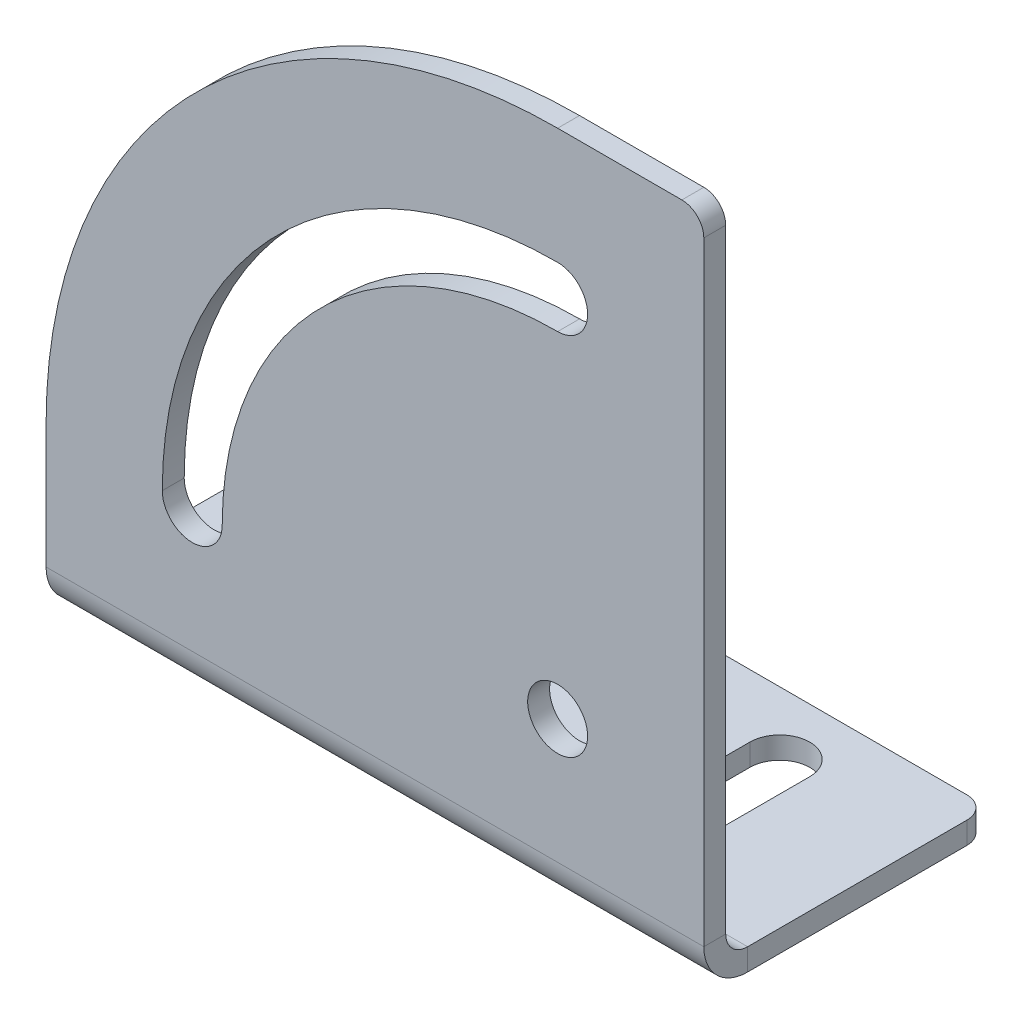
ISO-10303-21;
HEADER;
FILE_DESCRIPTION(('STEP AP214'),'2;1');
FILE_NAME('part.step','',(''),(''),'','','');
FILE_SCHEMA(('AUTOMOTIVE_DESIGN { 1 0 10303 214 1 1 1 1 }'));
ENDSEC;
DATA;
#1=APPLICATION_CONTEXT('core data for automotive mechanical design processes');
#2=APPLICATION_PROTOCOL_DEFINITION('international standard','automotive_design',2000,#1);
#3=PRODUCT_CONTEXT('',#1,'mechanical');
#4=PRODUCT('Part','Part','',(#3));
#5=PRODUCT_RELATED_PRODUCT_CATEGORY('part','',(#4));
#6=PRODUCT_DEFINITION_FORMATION('','',#4);
#7=PRODUCT_DEFINITION_CONTEXT('part definition',#1,'design');
#8=PRODUCT_DEFINITION('design','',#6,#7);
#9=PRODUCT_DEFINITION_SHAPE('','',#8);
#10=(LENGTH_UNIT() NAMED_UNIT(*) SI_UNIT(.MILLI.,.METRE.));
#11=(NAMED_UNIT(*) PLANE_ANGLE_UNIT() SI_UNIT($,.RADIAN.));
#12=(NAMED_UNIT(*) SI_UNIT($,.STERADIAN.) SOLID_ANGLE_UNIT());
#13=UNCERTAINTY_MEASURE_WITH_UNIT(LENGTH_MEASURE(1.E-05),#10,'distance_accuracy_value','');
#14=(GEOMETRIC_REPRESENTATION_CONTEXT(3) GLOBAL_UNCERTAINTY_ASSIGNED_CONTEXT((#13)) GLOBAL_UNIT_ASSIGNED_CONTEXT((#10,
#11,#12)) REPRESENTATION_CONTEXT('',''));
#15=CARTESIAN_POINT('',(0.,0.,0.));
#16=DIRECTION('',(0.,0.,1.));
#17=DIRECTION('',(1.,0.,0.));
#18=AXIS2_PLACEMENT_3D('',#15,#16,#17);
#19=CARTESIAN_POINT('',(0.,-20.,-15.6));
#20=DIRECTION('',(0.,1.,0.));
#21=DIRECTION('',(-1.,0.,0.));
#22=AXIS2_PLACEMENT_3D('',#19,#20,#21);
#23=CYLINDRICAL_SURFACE('',#22,4.1);
#24=DIRECTION('',(0.,1.,0.));
#25=VECTOR('',#24,1.);
#26=CARTESIAN_POINT('',(4.10000000000001,-20.,-15.6));
#27=LINE('',#26,#25);
#28=CARTESIAN_POINT('',(4.10000000000001,-23.,-15.6));
#29=VERTEX_POINT('',#28);
#30=CARTESIAN_POINT('',(4.10000000000001,-20.,-15.6));
#31=VERTEX_POINT('',#30);
#32=EDGE_CURVE('E382',#29,#31,#27,.T.);
#33=ORIENTED_EDGE('',*,*,#32,.F.);
#34=CARTESIAN_POINT('',(0.,-23.,-15.6));
#35=DIRECTION('',(0.,1.,0.));
#36=DIRECTION('',(0.,0.,1.));
#37=AXIS2_PLACEMENT_3D('',#34,#35,#36);
#38=CIRCLE('',#37,4.1);
#39=CARTESIAN_POINT('',(-4.09999999999999,-23.,-15.6));
#40=VERTEX_POINT('',#39);
#41=EDGE_CURVE('E341',#40,#29,#38,.T.);
#42=ORIENTED_EDGE('',*,*,#41,.F.);
#43=DIRECTION('',(0.,1.,0.));
#44=VECTOR('',#43,1.);
#45=CARTESIAN_POINT('',(-4.1,-20.,-15.6));
#46=LINE('',#45,#44);
#47=CARTESIAN_POINT('',(-4.1,-20.,-15.6));
#48=VERTEX_POINT('',#47);
#49=EDGE_CURVE('E380',#40,#48,#46,.T.);
#50=ORIENTED_EDGE('',*,*,#49,.T.);
#51=CARTESIAN_POINT('',(0.,-20.,-15.6));
#52=DIRECTION('',(0.,1.,0.));
#53=DIRECTION('',(0.,0.,1.));
#54=AXIS2_PLACEMENT_3D('',#51,#52,#53);
#55=CIRCLE('',#54,4.1);
#56=EDGE_CURVE('E215',#48,#31,#55,.T.);
#57=ORIENTED_EDGE('',*,*,#56,.T.);
#58=EDGE_LOOP('',(#33,#42,#50,#57));
#59=FACE_BOUND('',#58,.T.);
#60=ADVANCED_FACE('F16',(#59),#23,.F.);
#61=CARTESIAN_POINT('',(-4.1,-20.,-27.4));
#62=DIRECTION('',(-1.,0.,0.));
#63=DIRECTION('',(0.,0.,1.));
#64=AXIS2_PLACEMENT_3D('',#61,#62,#63);
#65=PLANE('',#64);
#66=ORIENTED_EDGE('',*,*,#49,.F.);
#67=DIRECTION('',(0.,0.,1.));
#68=VECTOR('',#67,1.);
#69=CARTESIAN_POINT('',(-4.09999999999999,-23.,-36.));
#70=LINE('',#69,#68);
#71=CARTESIAN_POINT('',(-4.09999999999999,-23.,-27.4));
#72=VERTEX_POINT('',#71);
#73=EDGE_CURVE('E317',#72,#40,#70,.T.);
#74=ORIENTED_EDGE('',*,*,#73,.F.);
#75=DIRECTION('',(0.,1.,0.));
#76=VECTOR('',#75,1.);
#77=CARTESIAN_POINT('',(-4.09999999999999,-20.,-27.4));
#78=LINE('',#77,#76);
#79=CARTESIAN_POINT('',(-4.09999999999999,-20.,-27.4));
#80=VERTEX_POINT('',#79);
#81=EDGE_CURVE('E378',#72,#80,#78,.T.);
#82=ORIENTED_EDGE('',*,*,#81,.T.);
#83=DIRECTION('',(0.,0.,1.));
#84=VECTOR('',#83,1.);
#85=CARTESIAN_POINT('',(-4.1,-20.,-27.4));
#86=LINE('',#85,#84);
#87=EDGE_CURVE('E218',#80,#48,#86,.T.);
#88=ORIENTED_EDGE('',*,*,#87,.T.);
#89=EDGE_LOOP('',(#66,#74,#82,#88));
#90=FACE_BOUND('',#89,.T.);
#91=ADVANCED_FACE('F423',(#90),#65,.F.);
#92=CARTESIAN_POINT('',(0.,-20.,-27.4));
#93=DIRECTION('',(0.,1.,0.));
#94=DIRECTION('',(-1.,0.,0.));
#95=AXIS2_PLACEMENT_3D('',#92,#93,#94);
#96=CYLINDRICAL_SURFACE('',#95,4.1);
#97=ORIENTED_EDGE('',*,*,#81,.F.);
#98=CARTESIAN_POINT('',(0.,-23.,-27.4));
#99=DIRECTION('',(0.,1.,0.));
#100=DIRECTION('',(0.,0.,1.));
#101=AXIS2_PLACEMENT_3D('',#98,#99,#100);
#102=CIRCLE('',#101,4.1);
#103=CARTESIAN_POINT('',(4.10000000000001,-23.,-27.4));
#104=VERTEX_POINT('',#103);
#105=EDGE_CURVE('E331',#104,#72,#102,.T.);
#106=ORIENTED_EDGE('',*,*,#105,.F.);
#107=DIRECTION('',(0.,1.,0.));
#108=VECTOR('',#107,1.);
#109=CARTESIAN_POINT('',(4.1,-20.,-27.4));
#110=LINE('',#109,#108);
#111=CARTESIAN_POINT('',(4.1,-20.,-27.4));
#112=VERTEX_POINT('',#111);
#113=EDGE_CURVE('E376',#104,#112,#110,.T.);
#114=ORIENTED_EDGE('',*,*,#113,.T.);
#115=CARTESIAN_POINT('',(0.,-20.,-27.4));
#116=DIRECTION('',(0.,1.,0.));
#117=DIRECTION('',(0.,0.,1.));
#118=AXIS2_PLACEMENT_3D('',#115,#116,#117);
#119=CIRCLE('',#118,4.1);
#120=EDGE_CURVE('E209',#112,#80,#119,.T.);
#121=ORIENTED_EDGE('',*,*,#120,.T.);
#122=EDGE_LOOP('',(#97,#106,#114,#121));
#123=FACE_BOUND('',#122,.T.);
#124=ADVANCED_FACE('F429',(#123),#96,.F.);
#125=CARTESIAN_POINT('',(-50.,-20.,-15.6));
#126=DIRECTION('',(0.,1.,0.));
#127=DIRECTION('',(-1.,0.,0.));
#128=AXIS2_PLACEMENT_3D('',#125,#126,#127);
#129=CYLINDRICAL_SURFACE('',#128,4.10000000000001);
#130=DIRECTION('',(0.,1.,0.));
#131=VECTOR('',#130,1.);
#132=CARTESIAN_POINT('',(-45.9,-20.,-15.6));
#133=LINE('',#132,#131);
#134=CARTESIAN_POINT('',(-45.9,-23.,-15.6));
#135=VERTEX_POINT('',#134);
#136=CARTESIAN_POINT('',(-45.9,-20.,-15.6));
#137=VERTEX_POINT('',#136);
#138=EDGE_CURVE('E203',#135,#137,#133,.T.);
#139=ORIENTED_EDGE('',*,*,#138,.F.);
#140=CARTESIAN_POINT('',(-50.,-23.,-15.6));
#141=DIRECTION('',(0.,1.,0.));
#142=DIRECTION('',(0.,0.,1.));
#143=AXIS2_PLACEMENT_3D('',#140,#141,#142);
#144=CIRCLE('',#143,4.10000000000001);
#145=CARTESIAN_POINT('',(-54.1,-23.,-15.6));
#146=VERTEX_POINT('',#145);
#147=EDGE_CURVE('E332',#146,#135,#144,.T.);
#148=ORIENTED_EDGE('',*,*,#147,.F.);
#149=DIRECTION('',(0.,1.,0.));
#150=VECTOR('',#149,1.);
#151=CARTESIAN_POINT('',(-54.1,-20.,-15.6));
#152=LINE('',#151,#150);
#153=CARTESIAN_POINT('',(-54.1,-20.,-15.6));
#154=VERTEX_POINT('',#153);
#155=EDGE_CURVE('E374',#146,#154,#152,.T.);
#156=ORIENTED_EDGE('',*,*,#155,.T.);
#157=CARTESIAN_POINT('',(-50.,-20.,-15.6));
#158=DIRECTION('',(0.,1.,0.));
#159=DIRECTION('',(0.,0.,1.));
#160=AXIS2_PLACEMENT_3D('',#157,#158,#159);
#161=CIRCLE('',#160,4.10000000000001);
#162=EDGE_CURVE('E204',#154,#137,#161,.T.);
#163=ORIENTED_EDGE('',*,*,#162,.T.);
#164=EDGE_LOOP('',(#139,#148,#156,#163));
#165=FACE_BOUND('',#164,.T.);
#166=ADVANCED_FACE('F515',(#165),#129,.F.);
#167=CARTESIAN_POINT('',(-54.1,-20.,-27.4));
#168=DIRECTION('',(-1.,0.,0.));
#169=DIRECTION('',(0.,0.,1.));
#170=AXIS2_PLACEMENT_3D('',#167,#168,#169);
#171=PLANE('',#170);
#172=ORIENTED_EDGE('',*,*,#155,.F.);
#173=DIRECTION('',(0.,0.,1.));
#174=VECTOR('',#173,1.);
#175=CARTESIAN_POINT('',(-54.1,-23.,-36.));
#176=LINE('',#175,#174);
#177=CARTESIAN_POINT('',(-54.1,-23.,-27.4));
#178=VERTEX_POINT('',#177);
#179=EDGE_CURVE('E328',#178,#146,#176,.T.);
#180=ORIENTED_EDGE('',*,*,#179,.F.);
#181=DIRECTION('',(0.,1.,0.));
#182=VECTOR('',#181,1.);
#183=CARTESIAN_POINT('',(-54.1,-20.,-27.4));
#184=LINE('',#183,#182);
#185=CARTESIAN_POINT('',(-54.1,-20.,-27.4));
#186=VERTEX_POINT('',#185);
#187=EDGE_CURVE('E188',#178,#186,#184,.T.);
#188=ORIENTED_EDGE('',*,*,#187,.T.);
#189=DIRECTION('',(0.,0.,1.));
#190=VECTOR('',#189,1.);
#191=CARTESIAN_POINT('',(-54.1,-20.,-27.4));
#192=LINE('',#191,#190);
#193=EDGE_CURVE('E199',#186,#154,#192,.T.);
#194=ORIENTED_EDGE('',*,*,#193,.T.);
#195=EDGE_LOOP('',(#172,#180,#188,#194));
#196=FACE_BOUND('',#195,.T.);
#197=ADVANCED_FACE('F512',(#196),#171,.F.);
#198=CARTESIAN_POINT('',(-50.,-20.,-27.4));
#199=DIRECTION('',(0.,1.,0.));
#200=DIRECTION('',(-1.,0.,0.));
#201=AXIS2_PLACEMENT_3D('',#198,#199,#200);
#202=CYLINDRICAL_SURFACE('',#201,4.10000000000001);
#203=ORIENTED_EDGE('',*,*,#187,.F.);
#204=CARTESIAN_POINT('',(-50.,-23.,-27.4));
#205=DIRECTION('',(0.,1.,0.));
#206=DIRECTION('',(0.,0.,1.));
#207=AXIS2_PLACEMENT_3D('',#204,#205,#206);
#208=CIRCLE('',#207,4.10000000000001);
#209=CARTESIAN_POINT('',(-45.9,-23.,-27.4));
#210=VERTEX_POINT('',#209);
#211=EDGE_CURVE('E183',#210,#178,#208,.T.);
#212=ORIENTED_EDGE('',*,*,#211,.F.);
#213=DIRECTION('',(0.,1.,0.));
#214=VECTOR('',#213,1.);
#215=CARTESIAN_POINT('',(-45.9,-20.,-27.4));
#216=LINE('',#215,#214);
#217=CARTESIAN_POINT('',(-45.9,-20.,-27.4));
#218=VERTEX_POINT('',#217);
#219=EDGE_CURVE('E177',#210,#218,#216,.T.);
#220=ORIENTED_EDGE('',*,*,#219,.T.);
#221=CARTESIAN_POINT('',(-50.,-20.,-27.4));
#222=DIRECTION('',(0.,1.,0.));
#223=DIRECTION('',(0.,0.,1.));
#224=AXIS2_PLACEMENT_3D('',#221,#222,#223);
#225=CIRCLE('',#224,4.10000000000001);
#226=EDGE_CURVE('E180',#218,#186,#225,.T.);
#227=ORIENTED_EDGE('',*,*,#226,.T.);
#228=EDGE_LOOP('',(#203,#212,#220,#227));
#229=FACE_BOUND('',#228,.T.);
#230=ADVANCED_FACE('F179',(#229),#202,.F.);
#231=CARTESIAN_POINT('',(20.,-20.,-36.));
#232=DIRECTION('',(-1.,0.,0.));
#233=DIRECTION('',(0.,0.,1.));
#234=AXIS2_PLACEMENT_3D('',#231,#232,#233);
#235=PLANE('',#234);
#236=DIRECTION('',(0.,1.,0.));
#237=VECTOR('',#236,1.);
#238=CARTESIAN_POINT('',(20.,-20.,-3.));
#239=LINE('',#238,#237);
#240=CARTESIAN_POINT('',(20.,-23.,-3.));
#241=VERTEX_POINT('',#240);
#242=CARTESIAN_POINT('',(20.,-20.,-3.));
#243=VERTEX_POINT('',#242);
#244=EDGE_CURVE('E189',#241,#243,#239,.T.);
#245=ORIENTED_EDGE('',*,*,#244,.F.);
#246=DIRECTION('',(0.,0.,1.));
#247=VECTOR('',#246,1.);
#248=CARTESIAN_POINT('',(20.,-23.,-36.));
#249=LINE('',#248,#247);
#250=CARTESIAN_POINT('',(20.,-23.,-33.));
#251=VERTEX_POINT('',#250);
#252=EDGE_CURVE('E310',#251,#241,#249,.T.);
#253=ORIENTED_EDGE('',*,*,#252,.F.);
#254=DIRECTION('',(0.,1.,0.));
#255=VECTOR('',#254,1.);
#256=CARTESIAN_POINT('',(20.,-20.,-33.));
#257=LINE('',#256,#255);
#258=CARTESIAN_POINT('',(20.,-20.,-33.));
#259=VERTEX_POINT('',#258);
#260=EDGE_CURVE('E369',#251,#259,#257,.T.);
#261=ORIENTED_EDGE('',*,*,#260,.T.);
#262=DIRECTION('',(0.,0.,1.));
#263=VECTOR('',#262,1.);
#264=CARTESIAN_POINT('',(20.,-20.,-36.));
#265=LINE('',#264,#263);
#266=EDGE_CURVE('E230',#259,#243,#265,.T.);
#267=ORIENTED_EDGE('',*,*,#266,.T.);
#268=EDGE_LOOP('',(#245,#253,#261,#267));
#269=FACE_BOUND('',#268,.T.);
#270=ADVANCED_FACE('F473',(#269),#235,.F.);
#271=CARTESIAN_POINT('',(17.,-20.,-33.));
#272=DIRECTION('',(0.,1.,0.));
#273=DIRECTION('',(-1.,0.,0.));
#274=AXIS2_PLACEMENT_3D('',#271,#272,#273);
#275=CYLINDRICAL_SURFACE('',#274,3.);
#276=ORIENTED_EDGE('',*,*,#260,.F.);
#277=CARTESIAN_POINT('',(17.,-23.,-33.));
#278=DIRECTION('',(0.,1.,0.));
#279=DIRECTION('',(-1.,0.,0.));
#280=AXIS2_PLACEMENT_3D('',#277,#278,#279);
#281=CIRCLE('',#280,3.);
#282=CARTESIAN_POINT('',(17.,-23.,-36.));
#283=VERTEX_POINT('',#282);
#284=EDGE_CURVE('E284',#251,#283,#281,.T.);
#285=ORIENTED_EDGE('',*,*,#284,.T.);
#286=DIRECTION('',(0.,1.,0.));
#287=VECTOR('',#286,1.);
#288=CARTESIAN_POINT('',(17.,-20.,-36.));
#289=LINE('',#288,#287);
#290=CARTESIAN_POINT('',(17.,-20.,-36.));
#291=VERTEX_POINT('',#290);
#292=EDGE_CURVE('E367',#283,#291,#289,.T.);
#293=ORIENTED_EDGE('',*,*,#292,.T.);
#294=CARTESIAN_POINT('',(17.,-20.,-33.));
#295=DIRECTION('',(0.,1.,0.));
#296=DIRECTION('',(-1.,0.,0.));
#297=AXIS2_PLACEMENT_3D('',#294,#295,#296);
#298=CIRCLE('',#297,3.);
#299=EDGE_CURVE('E233',#259,#291,#298,.T.);
#300=ORIENTED_EDGE('',*,*,#299,.F.);
#301=EDGE_LOOP('',(#276,#285,#293,#300));
#302=FACE_BOUND('',#301,.T.);
#303=ADVANCED_FACE('F478',(#302),#275,.T.);
#304=CARTESIAN_POINT('',(-70.,-20.,-36.));
#305=DIRECTION('',(0.,0.,-1.));
#306=DIRECTION('',(-1.,0.,0.));
#307=AXIS2_PLACEMENT_3D('',#304,#305,#306);
#308=PLANE('',#307);
#309=ORIENTED_EDGE('',*,*,#292,.F.);
#310=DIRECTION('',(-1.,0.,0.));
#311=VECTOR('',#310,1.);
#312=CARTESIAN_POINT('',(-70.,-23.,-36.));
#313=LINE('',#312,#311);
#314=CARTESIAN_POINT('',(-67.,-23.,-36.));
#315=VERTEX_POINT('',#314);
#316=EDGE_CURVE('E314',#283,#315,#313,.T.);
#317=ORIENTED_EDGE('',*,*,#316,.T.);
#318=DIRECTION('',(0.,1.,0.));
#319=VECTOR('',#318,1.);
#320=CARTESIAN_POINT('',(-67.,-20.,-36.));
#321=LINE('',#320,#319);
#322=CARTESIAN_POINT('',(-67.,-20.,-36.));
#323=VERTEX_POINT('',#322);
#324=EDGE_CURVE('E365',#315,#323,#321,.T.);
#325=ORIENTED_EDGE('',*,*,#324,.T.);
#326=DIRECTION('',(-1.,0.,0.));
#327=VECTOR('',#326,1.);
#328=CARTESIAN_POINT('',(-70.,-20.,-36.));
#329=LINE('',#328,#327);
#330=EDGE_CURVE('E221',#291,#323,#329,.T.);
#331=ORIENTED_EDGE('',*,*,#330,.F.);
#332=EDGE_LOOP('',(#309,#317,#325,#331));
#333=FACE_BOUND('',#332,.T.);
#334=ADVANCED_FACE('F482',(#333),#308,.T.);
#335=CARTESIAN_POINT('',(-67.,-20.,-33.));
#336=DIRECTION('',(0.,1.,0.));
#337=DIRECTION('',(-1.,0.,0.));
#338=AXIS2_PLACEMENT_3D('',#335,#336,#337);
#339=CYLINDRICAL_SURFACE('',#338,3.);
#340=ORIENTED_EDGE('',*,*,#324,.F.);
#341=CARTESIAN_POINT('',(-67.,-23.,-33.));
#342=DIRECTION('',(0.,1.,0.));
#343=DIRECTION('',(-1.,0.,0.));
#344=AXIS2_PLACEMENT_3D('',#341,#342,#343);
#345=CIRCLE('',#344,3.);
#346=CARTESIAN_POINT('',(-70.,-23.,-33.));
#347=VERTEX_POINT('',#346);
#348=EDGE_CURVE('E311',#315,#347,#345,.T.);
#349=ORIENTED_EDGE('',*,*,#348,.T.);
#350=DIRECTION('',(0.,1.,0.));
#351=VECTOR('',#350,1.);
#352=CARTESIAN_POINT('',(-70.,-20.,-33.));
#353=LINE('',#352,#351);
#354=CARTESIAN_POINT('',(-70.,-20.,-33.));
#355=VERTEX_POINT('',#354);
#356=EDGE_CURVE('E363',#347,#355,#353,.T.);
#357=ORIENTED_EDGE('',*,*,#356,.T.);
#358=CARTESIAN_POINT('',(-67.,-20.,-33.));
#359=DIRECTION('',(0.,1.,0.));
#360=DIRECTION('',(-1.,0.,0.));
#361=AXIS2_PLACEMENT_3D('',#358,#359,#360);
#362=CIRCLE('',#361,3.);
#363=EDGE_CURVE('E224',#323,#355,#362,.T.);
#364=ORIENTED_EDGE('',*,*,#363,.F.);
#365=EDGE_LOOP('',(#340,#349,#357,#364));
#366=FACE_BOUND('',#365,.T.);
#367=ADVANCED_FACE('F486',(#366),#339,.T.);
#368=CARTESIAN_POINT('',(-70.,-20.,-36.));
#369=DIRECTION('',(-1.,0.,0.));
#370=DIRECTION('',(0.,0.,1.));
#371=AXIS2_PLACEMENT_3D('',#368,#369,#370);
#372=PLANE('',#371);
#373=ORIENTED_EDGE('',*,*,#356,.F.);
#374=DIRECTION('',(0.,0.,1.));
#375=VECTOR('',#374,1.);
#376=CARTESIAN_POINT('',(-70.,-23.,-36.));
#377=LINE('',#376,#375);
#378=CARTESIAN_POINT('',(-70.,-23.,-3.));
#379=VERTEX_POINT('',#378);
#380=EDGE_CURVE('E307',#347,#379,#377,.T.);
#381=ORIENTED_EDGE('',*,*,#380,.T.);
#382=DIRECTION('',(0.,1.,0.));
#383=VECTOR('',#382,1.);
#384=CARTESIAN_POINT('',(-70.,-20.,-3.));
#385=LINE('',#384,#383);
#386=CARTESIAN_POINT('',(-70.,-20.,-3.));
#387=VERTEX_POINT('',#386);
#388=EDGE_CURVE('E361',#379,#387,#385,.T.);
#389=ORIENTED_EDGE('',*,*,#388,.T.);
#390=DIRECTION('',(0.,0.,1.));
#391=VECTOR('',#390,1.);
#392=CARTESIAN_POINT('',(-70.,-20.,-36.));
#393=LINE('',#392,#391);
#394=EDGE_CURVE('E227',#355,#387,#393,.T.);
#395=ORIENTED_EDGE('',*,*,#394,.F.);
#396=EDGE_LOOP('',(#373,#381,#389,#395));
#397=FACE_BOUND('',#396,.T.);
#398=ADVANCED_FACE('F487',(#397),#372,.T.);
#399=CARTESIAN_POINT('',(-70.,-17.,-3.));
#400=DIRECTION('',(1.,0.,0.));
#401=DIRECTION('',(0.,0.,-1.));
#402=AXIS2_PLACEMENT_3D('',#399,#400,#401);
#403=PLANE('',#402);
#404=ORIENTED_EDGE('',*,*,#388,.F.);
#405=CARTESIAN_POINT('',(-70.,-17.,-3.));
#406=DIRECTION('',(-1.,0.,0.));
#407=DIRECTION('',(0.,-1.,0.));
#408=AXIS2_PLACEMENT_3D('',#405,#406,#407);
#409=CIRCLE('',#408,6.);
#410=CARTESIAN_POINT('',(-70.,-17.,3.));
#411=VERTEX_POINT('',#410);
#412=EDGE_CURVE('E303',#379,#411,#409,.T.);
#413=ORIENTED_EDGE('',*,*,#412,.T.);
#414=DIRECTION('',(0.,0.,-1.));
#415=VECTOR('',#414,1.);
#416=CARTESIAN_POINT('',(-70.,-17.,0.));
#417=LINE('',#416,#415);
#418=CARTESIAN_POINT('',(-70.,-17.,0.));
#419=VERTEX_POINT('',#418);
#420=EDGE_CURVE('E359',#411,#419,#417,.T.);
#421=ORIENTED_EDGE('',*,*,#420,.T.);
#422=CARTESIAN_POINT('',(-70.,-17.,-3.));
#423=DIRECTION('',(-1.,0.,0.));
#424=DIRECTION('',(0.,0.,1.));
#425=AXIS2_PLACEMENT_3D('',#422,#423,#424);
#426=CIRCLE('',#425,3.);
#427=EDGE_CURVE('E200',#387,#419,#426,.T.);
#428=ORIENTED_EDGE('',*,*,#427,.F.);
#429=EDGE_LOOP('',(#404,#413,#421,#428));
#430=FACE_BOUND('',#429,.T.);
#431=ADVANCED_FACE('F466',(#430),#403,.F.);
#432=CARTESIAN_POINT('',(-70.,-20.,0.));
#433=DIRECTION('',(1.,0.,0.));
#434=DIRECTION('',(0.,-1.,0.));
#435=AXIS2_PLACEMENT_3D('',#432,#433,#434);
#436=PLANE('',#435);
#437=ORIENTED_EDGE('',*,*,#420,.F.);
#438=DIRECTION('',(0.,1.,0.));
#439=VECTOR('',#438,1.);
#440=CARTESIAN_POINT('',(-70.,0.,3.));
#441=LINE('',#440,#439);
#442=CARTESIAN_POINT('',(-70.,0.,3.));
#443=VERTEX_POINT('',#442);
#444=EDGE_CURVE('E288',#443,#411,#441,.F.);
#445=ORIENTED_EDGE('',*,*,#444,.F.);
#446=DIRECTION('',(0.,0.,-1.));
#447=VECTOR('',#446,1.);
#448=CARTESIAN_POINT('',(-70.,0.,0.));
#449=LINE('',#448,#447);
#450=CARTESIAN_POINT('',(-70.,0.,0.));
#451=VERTEX_POINT('',#450);
#452=EDGE_CURVE('E357',#443,#451,#449,.T.);
#453=ORIENTED_EDGE('',*,*,#452,.T.);
#454=DIRECTION('',(0.,-1.,0.));
#455=VECTOR('',#454,1.);
#456=CARTESIAN_POINT('',(-70.,-20.,0.));
#457=LINE('',#456,#455);
#458=EDGE_CURVE('E248',#451,#419,#457,.T.);
#459=ORIENTED_EDGE('',*,*,#458,.T.);
#460=EDGE_LOOP('',(#437,#445,#453,#459));
#461=FACE_BOUND('',#460,.T.);
#462=ADVANCED_FACE('F408',(#461),#436,.F.);
#463=CARTESIAN_POINT('',(0.,0.,0.));
#464=DIRECTION('',(0.,0.,-1.));
#465=DIRECTION('',(-1.,0.,0.));
#466=AXIS2_PLACEMENT_3D('',#463,#464,#465);
#467=CYLINDRICAL_SURFACE('',#466,70.);
#468=ORIENTED_EDGE('',*,*,#452,.F.);
#469=CARTESIAN_POINT('',(0.,0.,3.));
#470=DIRECTION('',(0.,0.,1.));
#471=DIRECTION('',(1.,0.,0.));
#472=AXIS2_PLACEMENT_3D('',#469,#470,#471);
#473=CIRCLE('',#472,70.);
#474=CARTESIAN_POINT('',(0.,70.,3.));
#475=VERTEX_POINT('',#474);
#476=EDGE_CURVE('E298',#475,#443,#473,.T.);
#477=ORIENTED_EDGE('',*,*,#476,.F.);
#478=DIRECTION('',(0.,0.,-1.));
#479=VECTOR('',#478,1.);
#480=CARTESIAN_POINT('',(0.,70.,0.));
#481=LINE('',#480,#479);
#482=CARTESIAN_POINT('',(0.,70.,0.));
#483=VERTEX_POINT('',#482);
#484=EDGE_CURVE('E354',#475,#483,#481,.T.);
#485=ORIENTED_EDGE('',*,*,#484,.T.);
#486=CARTESIAN_POINT('',(0.,0.,0.));
#487=DIRECTION('',(0.,0.,1.));
#488=DIRECTION('',(-1.,0.,0.));
#489=AXIS2_PLACEMENT_3D('',#486,#487,#488);
#490=CIRCLE('',#489,70.);
#491=EDGE_CURVE('E251',#483,#451,#490,.T.);
#492=ORIENTED_EDGE('',*,*,#491,.T.);
#493=EDGE_LOOP('',(#468,#477,#485,#492));
#494=FACE_BOUND('',#493,.T.);
#495=ADVANCED_FACE('F400',(#494),#467,.T.);
#496=CARTESIAN_POINT('',(20.,70.,0.));
#497=DIRECTION('',(0.,-1.,0.));
#498=DIRECTION('',(-1.,0.,0.));
#499=AXIS2_PLACEMENT_3D('',#496,#497,#498);
#500=PLANE('',#499);
#501=DIRECTION('',(-1.,0.,0.));
#502=VECTOR('',#501,1.);
#503=CARTESIAN_POINT('',(0.,70.,3.));
#504=LINE('',#503,#502);
#505=CARTESIAN_POINT('',(17.,70.,3.));
#506=VERTEX_POINT('',#505);
#507=EDGE_CURVE('E296',#506,#475,#504,.T.);
#508=ORIENTED_EDGE('',*,*,#507,.F.);
#509=DIRECTION('',(0.,0.,1.));
#510=VECTOR('',#509,1.);
#511=CARTESIAN_POINT('',(17.,70.,0.));
#512=LINE('',#511,#510);
#513=CARTESIAN_POINT('',(17.,70.,0.));
#514=VERTEX_POINT('',#513);
#515=EDGE_CURVE('E384',#506,#514,#512,.F.);
#516=ORIENTED_EDGE('',*,*,#515,.T.);
#517=DIRECTION('',(-1.,0.,0.));
#518=VECTOR('',#517,1.);
#519=CARTESIAN_POINT('',(20.,70.,0.));
#520=LINE('',#519,#518);
#521=EDGE_CURVE('E254',#514,#483,#520,.T.);
#522=ORIENTED_EDGE('',*,*,#521,.T.);
#523=ORIENTED_EDGE('',*,*,#484,.F.);
#524=EDGE_LOOP('',(#508,#516,#522,#523));
#525=FACE_BOUND('',#524,.T.);
#526=ADVANCED_FACE('F391',(#525),#500,.F.);
#527=CARTESIAN_POINT('',(20.,-20.,0.));
#528=DIRECTION('',(-1.,0.,0.));
#529=DIRECTION('',(0.,1.,0.));
#530=AXIS2_PLACEMENT_3D('',#527,#528,#529);
#531=PLANE('',#530);
#532=DIRECTION('',(0.,1.,0.));
#533=VECTOR('',#532,1.);
#534=CARTESIAN_POINT('',(20.,-20.,0.));
#535=LINE('',#534,#533);
#536=CARTESIAN_POINT('',(20.,-17.,0.));
#537=VERTEX_POINT('',#536);
#538=CARTESIAN_POINT('',(20.,66.9999999999999,0.));
#539=VERTEX_POINT('',#538);
#540=EDGE_CURVE('E256',#537,#539,#535,.T.);
#541=ORIENTED_EDGE('',*,*,#540,.T.);
#542=DIRECTION('',(0.,0.,1.));
#543=VECTOR('',#542,1.);
#544=CARTESIAN_POINT('',(20.,67.,0.));
#545=LINE('',#544,#543);
#546=CARTESIAN_POINT('',(20.,67.,3.));
#547=VERTEX_POINT('',#546);
#548=EDGE_CURVE('E24',#539,#547,#545,.T.);
#549=ORIENTED_EDGE('',*,*,#548,.T.);
#550=DIRECTION('',(0.,1.,0.));
#551=VECTOR('',#550,1.);
#552=CARTESIAN_POINT('',(20.,0.,3.));
#553=LINE('',#552,#551);
#554=CARTESIAN_POINT('',(20.,-17.,3.));
#555=VERTEX_POINT('',#554);
#556=EDGE_CURVE('E294',#555,#547,#553,.T.);
#557=ORIENTED_EDGE('',*,*,#556,.F.);
#558=DIRECTION('',(0.,0.,-1.));
#559=VECTOR('',#558,1.);
#560=CARTESIAN_POINT('',(20.,-17.,0.));
#561=LINE('',#560,#559);
#562=EDGE_CURVE('E352',#555,#537,#561,.T.);
#563=ORIENTED_EDGE('',*,*,#562,.T.);
#564=EDGE_LOOP('',(#541,#549,#557,#563));
#565=FACE_BOUND('',#564,.T.);
#566=ADVANCED_FACE('F601',(#565),#531,.F.);
#567=CARTESIAN_POINT('',(0.,0.,0.));
#568=DIRECTION('',(0.,0.,-1.));
#569=DIRECTION('',(-1.,0.,0.));
#570=AXIS2_PLACEMENT_3D('',#567,#568,#569);
#571=CYLINDRICAL_SURFACE('',#570,54.1);
#572=DIRECTION('',(0.,0.,-1.));
#573=VECTOR('',#572,1.);
#574=CARTESIAN_POINT('',(0.,54.1,0.));
#575=LINE('',#574,#573);
#576=CARTESIAN_POINT('',(0.,54.1,3.));
#577=VERTEX_POINT('',#576);
#578=CARTESIAN_POINT('',(0.,54.1,0.));
#579=VERTEX_POINT('',#578);
#580=EDGE_CURVE('E350',#577,#579,#575,.T.);
#581=ORIENTED_EDGE('',*,*,#580,.F.);
#582=CARTESIAN_POINT('',(0.,0.,3.));
#583=DIRECTION('',(0.,0.,1.));
#584=DIRECTION('',(1.,0.,0.));
#585=AXIS2_PLACEMENT_3D('',#582,#583,#584);
#586=CIRCLE('',#585,54.1);
#587=CARTESIAN_POINT('',(-54.1,0.,3.));
#588=VERTEX_POINT('',#587);
#589=EDGE_CURVE('E289',#577,#588,#586,.T.);
#590=ORIENTED_EDGE('',*,*,#589,.T.);
#591=DIRECTION('',(0.,0.,-1.));
#592=VECTOR('',#591,1.);
#593=CARTESIAN_POINT('',(-54.1,0.,0.));
#594=LINE('',#593,#592);
#595=CARTESIAN_POINT('',(-54.1,0.,0.));
#596=VERTEX_POINT('',#595);
#597=EDGE_CURVE('E348',#588,#596,#594,.T.);
#598=ORIENTED_EDGE('',*,*,#597,.T.);
#599=CARTESIAN_POINT('',(0.,0.,0.));
#600=DIRECTION('',(0.,0.,1.));
#601=DIRECTION('',(1.,0.,0.));
#602=AXIS2_PLACEMENT_3D('',#599,#600,#601);
#603=CIRCLE('',#602,54.1);
#604=EDGE_CURVE('E242',#579,#596,#603,.T.);
#605=ORIENTED_EDGE('',*,*,#604,.F.);
#606=EDGE_LOOP('',(#581,#590,#598,#605));
#607=FACE_BOUND('',#606,.T.);
#608=ADVANCED_FACE('F611',(#607),#571,.F.);
#609=CARTESIAN_POINT('',(-50.,0.,0.));
#610=DIRECTION('',(0.,0.,-1.));
#611=DIRECTION('',(-1.,0.,0.));
#612=AXIS2_PLACEMENT_3D('',#609,#610,#611);
#613=CYLINDRICAL_SURFACE('',#612,4.1);
#614=ORIENTED_EDGE('',*,*,#597,.F.);
#615=CARTESIAN_POINT('',(-50.,0.,3.));
#616=DIRECTION('',(0.,0.,1.));
#617=DIRECTION('',(1.,0.,0.));
#618=AXIS2_PLACEMENT_3D('',#615,#616,#617);
#619=CIRCLE('',#618,4.1);
#620=CARTESIAN_POINT('',(-45.9,0.,3.));
#621=VERTEX_POINT('',#620);
#622=EDGE_CURVE('E285',#588,#621,#619,.T.);
#623=ORIENTED_EDGE('',*,*,#622,.T.);
#624=DIRECTION('',(0.,0.,-1.));
#625=VECTOR('',#624,1.);
#626=CARTESIAN_POINT('',(-45.9,0.,0.));
#627=LINE('',#626,#625);
#628=CARTESIAN_POINT('',(-45.9,0.,0.));
#629=VERTEX_POINT('',#628);
#630=EDGE_CURVE('E346',#621,#629,#627,.T.);
#631=ORIENTED_EDGE('',*,*,#630,.T.);
#632=CARTESIAN_POINT('',(-50.,0.,0.));
#633=DIRECTION('',(0.,0.,1.));
#634=DIRECTION('',(1.,0.,0.));
#635=AXIS2_PLACEMENT_3D('',#632,#633,#634);
#636=CIRCLE('',#635,4.1);
#637=EDGE_CURVE('E245',#596,#629,#636,.T.);
#638=ORIENTED_EDGE('',*,*,#637,.F.);
#639=EDGE_LOOP('',(#614,#623,#631,#638));
#640=FACE_BOUND('',#639,.T.);
#641=ADVANCED_FACE('F620',(#640),#613,.F.);
#642=CARTESIAN_POINT('',(0.,0.,0.));
#643=DIRECTION('',(0.,0.,-1.));
#644=DIRECTION('',(-1.,0.,0.));
#645=AXIS2_PLACEMENT_3D('',#642,#643,#644);
#646=CYLINDRICAL_SURFACE('',#645,45.9);
#647=ORIENTED_EDGE('',*,*,#630,.F.);
#648=CARTESIAN_POINT('',(0.,0.,3.));
#649=DIRECTION('',(0.,0.,-1.));
#650=DIRECTION('',(-1.,0.,0.));
#651=AXIS2_PLACEMENT_3D('',#648,#649,#650);
#652=CIRCLE('',#651,45.9);
#653=CARTESIAN_POINT('',(0.,45.9,3.));
#654=VERTEX_POINT('',#653);
#655=EDGE_CURVE('E280',#621,#654,#652,.T.);
#656=ORIENTED_EDGE('',*,*,#655,.T.);
#657=DIRECTION('',(0.,0.,-1.));
#658=VECTOR('',#657,1.);
#659=CARTESIAN_POINT('',(0.,45.9,0.));
#660=LINE('',#659,#658);
#661=CARTESIAN_POINT('',(0.,45.9,0.));
#662=VERTEX_POINT('',#661);
#663=EDGE_CURVE('E267',#654,#662,#660,.T.);
#664=ORIENTED_EDGE('',*,*,#663,.T.);
#665=CARTESIAN_POINT('',(0.,0.,0.));
#666=DIRECTION('',(0.,0.,-1.));
#667=DIRECTION('',(1.,0.,0.));
#668=AXIS2_PLACEMENT_3D('',#665,#666,#667);
#669=CIRCLE('',#668,45.9);
#670=EDGE_CURVE('E236',#629,#662,#669,.T.);
#671=ORIENTED_EDGE('',*,*,#670,.F.);
#672=EDGE_LOOP('',(#647,#656,#664,#671));
#673=FACE_BOUND('',#672,.T.);
#674=ADVANCED_FACE('F444',(#673),#646,.T.);
#675=CARTESIAN_POINT('',(-45.9,-20.,-27.4));
#676=DIRECTION('',(1.,0.,0.));
#677=DIRECTION('',(0.,0.,-1.));
#678=AXIS2_PLACEMENT_3D('',#675,#676,#677);
#679=PLANE('',#678);
#680=DIRECTION('',(0.,0.,1.));
#681=VECTOR('',#680,1.);
#682=CARTESIAN_POINT('',(-45.9,-23.,-36.));
#683=LINE('',#682,#681);
#684=EDGE_CURVE('E327',#135,#210,#683,.F.);
#685=ORIENTED_EDGE('',*,*,#684,.F.);
#686=ORIENTED_EDGE('',*,*,#138,.T.);
#687=DIRECTION('',(0.,0.,-1.));
#688=VECTOR('',#687,1.);
#689=CARTESIAN_POINT('',(-45.9,-20.,-27.4));
#690=LINE('',#689,#688);
#691=EDGE_CURVE('E196',#137,#218,#690,.T.);
#692=ORIENTED_EDGE('',*,*,#691,.T.);
#693=ORIENTED_EDGE('',*,*,#219,.F.);
#694=EDGE_LOOP('',(#685,#686,#692,#693));
#695=FACE_BOUND('',#694,.T.);
#696=ADVANCED_FACE('F202',(#695),#679,.F.);
#697=CARTESIAN_POINT('',(4.1,-20.,-27.4));
#698=DIRECTION('',(1.,0.,0.));
#699=DIRECTION('',(0.,0.,-1.));
#700=AXIS2_PLACEMENT_3D('',#697,#698,#699);
#701=PLANE('',#700);
#702=DIRECTION('',(0.,0.,1.));
#703=VECTOR('',#702,1.);
#704=CARTESIAN_POINT('',(4.10000000000001,-23.,-36.));
#705=LINE('',#704,#703);
#706=EDGE_CURVE('E338',#29,#104,#705,.F.);
#707=ORIENTED_EDGE('',*,*,#706,.F.);
#708=ORIENTED_EDGE('',*,*,#32,.T.);
#709=DIRECTION('',(0.,0.,-1.));
#710=VECTOR('',#709,1.);
#711=CARTESIAN_POINT('',(4.1,-20.,-27.4));
#712=LINE('',#711,#710);
#713=EDGE_CURVE('E212',#31,#112,#712,.T.);
#714=ORIENTED_EDGE('',*,*,#713,.T.);
#715=ORIENTED_EDGE('',*,*,#113,.F.);
#716=EDGE_LOOP('',(#707,#708,#714,#715));
#717=FACE_BOUND('',#716,.T.);
#718=ADVANCED_FACE('F433',(#717),#701,.F.);
#719=CARTESIAN_POINT('',(0.,50.,0.));
#720=DIRECTION('',(0.,0.,-1.));
#721=DIRECTION('',(-1.,0.,0.));
#722=AXIS2_PLACEMENT_3D('',#719,#720,#721);
#723=CYLINDRICAL_SURFACE('',#722,4.1);
#724=CARTESIAN_POINT('',(0.,50.,3.));
#725=DIRECTION('',(0.,0.,1.));
#726=DIRECTION('',(1.,0.,0.));
#727=AXIS2_PLACEMENT_3D('',#724,#725,#726);
#728=CIRCLE('',#727,4.1);
#729=EDGE_CURVE('E283',#654,#577,#728,.T.);
#730=ORIENTED_EDGE('',*,*,#729,.T.);
#731=ORIENTED_EDGE('',*,*,#580,.T.);
#732=CARTESIAN_POINT('',(0.,50.,0.));
#733=DIRECTION('',(0.,0.,1.));
#734=DIRECTION('',(1.,0.,0.));
#735=AXIS2_PLACEMENT_3D('',#732,#733,#734);
#736=CIRCLE('',#735,4.1);
#737=EDGE_CURVE('E239',#662,#579,#736,.T.);
#738=ORIENTED_EDGE('',*,*,#737,.F.);
#739=ORIENTED_EDGE('',*,*,#663,.F.);
#740=EDGE_LOOP('',(#730,#731,#738,#739));
#741=FACE_BOUND('',#740,.T.);
#742=ADVANCED_FACE('F435',(#741),#723,.F.);
#743=CARTESIAN_POINT('',(20.,-17.,-3.));
#744=DIRECTION('',(1.,0.,0.));
#745=DIRECTION('',(0.,1.,0.));
#746=AXIS2_PLACEMENT_3D('',#743,#744,#745);
#747=PLANE('',#746);
#748=CARTESIAN_POINT('',(20.,-17.,-3.));
#749=DIRECTION('',(-1.,0.,0.));
#750=DIRECTION('',(0.,-1.,0.));
#751=AXIS2_PLACEMENT_3D('',#748,#749,#750);
#752=CIRCLE('',#751,6.);
#753=EDGE_CURVE('E306',#555,#241,#752,.F.);
#754=ORIENTED_EDGE('',*,*,#753,.T.);
#755=ORIENTED_EDGE('',*,*,#244,.T.);
#756=CARTESIAN_POINT('',(20.,-17.,-3.));
#757=DIRECTION('',(-1.,0.,0.));
#758=DIRECTION('',(0.,-1.,0.));
#759=AXIS2_PLACEMENT_3D('',#756,#757,#758);
#760=CIRCLE('',#759,3.);
#761=EDGE_CURVE('E268',#537,#243,#760,.F.);
#762=ORIENTED_EDGE('',*,*,#761,.F.);
#763=ORIENTED_EDGE('',*,*,#562,.F.);
#764=EDGE_LOOP('',(#754,#755,#762,#763));
#765=FACE_BOUND('',#764,.T.);
#766=ADVANCED_FACE('F441',(#765),#747,.T.);
#767=CARTESIAN_POINT('',(0.,0.,0.));
#768=DIRECTION('',(0.,0.,-1.));
#769=DIRECTION('',(-1.,0.,0.));
#770=AXIS2_PLACEMENT_3D('',#767,#768,#769);
#771=CYLINDRICAL_SURFACE('',#770,4.1);
#772=CARTESIAN_POINT('',(0.,0.,0.));
#773=DIRECTION('',(0.,0.,1.));
#774=DIRECTION('',(1.,0.,0.));
#775=AXIS2_PLACEMENT_3D('',#772,#773,#774);
#776=CIRCLE('',#775,4.1);
#777=CARTESIAN_POINT('',(4.1,0.,0.));
#778=VERTEX_POINT('',#777);
#779=EDGE_CURVE('E258',#778,#778,#776,.T.);
#780=ORIENTED_EDGE('',*,*,#779,.F.);
#781=EDGE_LOOP('',(#780));
#782=FACE_BOUND('',#781,.T.);
#783=CARTESIAN_POINT('',(0.,0.,3.));
#784=DIRECTION('',(0.,0.,1.));
#785=DIRECTION('',(1.,0.,0.));
#786=AXIS2_PLACEMENT_3D('',#783,#784,#785);
#787=CIRCLE('',#786,4.1);
#788=CARTESIAN_POINT('',(4.1,0.,3.));
#789=VERTEX_POINT('',#788);
#790=EDGE_CURVE('E279',#789,#789,#787,.T.);
#791=ORIENTED_EDGE('',*,*,#790,.T.);
#792=EDGE_LOOP('',(#791));
#793=FACE_BOUND('',#792,.T.);
#794=ADVANCED_FACE('F506',(#782,#793),#771,.F.);
#795=CARTESIAN_POINT('',(0.,0.,0.));
#796=DIRECTION('',(0.,0.,-1.));
#797=DIRECTION('',(-1.,0.,0.));
#798=AXIS2_PLACEMENT_3D('',#795,#796,#797);
#799=PLANE('',#798);
#800=ORIENTED_EDGE('',*,*,#670,.T.);
#801=ORIENTED_EDGE('',*,*,#737,.T.);
#802=ORIENTED_EDGE('',*,*,#604,.T.);
#803=ORIENTED_EDGE('',*,*,#637,.T.);
#804=EDGE_LOOP('',(#800,#801,#802,#803));
#805=FACE_BOUND('',#804,.T.);
#806=ORIENTED_EDGE('',*,*,#521,.F.);
#807=CARTESIAN_POINT('',(17.,67.,0.));
#808=DIRECTION('',(0.,0.,-1.));
#809=DIRECTION('',(-1.,0.,0.));
#810=AXIS2_PLACEMENT_3D('',#807,#808,#809);
#811=CIRCLE('',#810,3.);
#812=EDGE_CURVE('E38',#514,#539,#811,.T.);
#813=ORIENTED_EDGE('',*,*,#812,.T.);
#814=ORIENTED_EDGE('',*,*,#540,.F.);
#815=DIRECTION('',(1.,0.,0.));
#816=VECTOR('',#815,1.);
#817=CARTESIAN_POINT('',(-70.,-17.,0.));
#818=LINE('',#817,#816);
#819=EDGE_CURVE('E264',#537,#419,#818,.F.);
#820=ORIENTED_EDGE('',*,*,#819,.T.);
#821=ORIENTED_EDGE('',*,*,#458,.F.);
#822=ORIENTED_EDGE('',*,*,#491,.F.);
#823=EDGE_LOOP('',(#806,#813,#814,#820,#821,#822));
#824=FACE_BOUND('',#823,.T.);
#825=ORIENTED_EDGE('',*,*,#779,.T.);
#826=EDGE_LOOP('',(#825));
#827=FACE_BOUND('',#826,.T.);
#828=ADVANCED_FACE('F396',(#805,#824,#827),#799,.T.);
#829=CARTESIAN_POINT('',(-70.,-20.,-36.));
#830=DIRECTION('',(0.,1.,0.));
#831=DIRECTION('',(-1.,0.,0.));
#832=AXIS2_PLACEMENT_3D('',#829,#830,#831);
#833=PLANE('',#832);
#834=ORIENTED_EDGE('',*,*,#226,.F.);
#835=ORIENTED_EDGE('',*,*,#691,.F.);
#836=ORIENTED_EDGE('',*,*,#162,.F.);
#837=ORIENTED_EDGE('',*,*,#193,.F.);
#838=EDGE_LOOP('',(#834,#835,#836,#837));
#839=FACE_BOUND('',#838,.T.);
#840=ORIENTED_EDGE('',*,*,#120,.F.);
#841=ORIENTED_EDGE('',*,*,#713,.F.);
#842=ORIENTED_EDGE('',*,*,#56,.F.);
#843=ORIENTED_EDGE('',*,*,#87,.F.);
#844=EDGE_LOOP('',(#840,#841,#842,#843));
#845=FACE_BOUND('',#844,.T.);
#846=ORIENTED_EDGE('',*,*,#394,.T.);
#847=DIRECTION('',(1.,0.,0.));
#848=VECTOR('',#847,1.);
#849=CARTESIAN_POINT('',(20.,-20.,-3.));
#850=LINE('',#849,#848);
#851=EDGE_CURVE('E261',#387,#243,#850,.T.);
#852=ORIENTED_EDGE('',*,*,#851,.T.);
#853=ORIENTED_EDGE('',*,*,#266,.F.);
#854=ORIENTED_EDGE('',*,*,#299,.T.);
#855=ORIENTED_EDGE('',*,*,#330,.T.);
#856=ORIENTED_EDGE('',*,*,#363,.T.);
#857=EDGE_LOOP('',(#846,#852,#853,#854,#855,#856));
#858=FACE_BOUND('',#857,.T.);
#859=ADVANCED_FACE('F193',(#839,#845,#858),#833,.T.);
#860=CARTESIAN_POINT('',(-70.,-17.,-3.));
#861=DIRECTION('',(-1.,0.,0.));
#862=DIRECTION('',(0.,-1.,0.));
#863=AXIS2_PLACEMENT_3D('',#860,#861,#862);
#864=CYLINDRICAL_SURFACE('',#863,3.);
#865=ORIENTED_EDGE('',*,*,#427,.T.);
#866=ORIENTED_EDGE('',*,*,#819,.F.);
#867=ORIENTED_EDGE('',*,*,#761,.T.);
#868=ORIENTED_EDGE('',*,*,#851,.F.);
#869=EDGE_LOOP('',(#865,#866,#867,#868));
#870=FACE_BOUND('',#869,.T.);
#871=ADVANCED_FACE('F459',(#870),#864,.F.);
#872=CARTESIAN_POINT('',(0.,0.,3.));
#873=DIRECTION('',(0.,0.,-1.));
#874=DIRECTION('',(-1.,0.,0.));
#875=AXIS2_PLACEMENT_3D('',#872,#873,#874);
#876=PLANE('',#875);
#877=ORIENTED_EDGE('',*,*,#655,.F.);
#878=ORIENTED_EDGE('',*,*,#622,.F.);
#879=ORIENTED_EDGE('',*,*,#589,.F.);
#880=ORIENTED_EDGE('',*,*,#729,.F.);
#881=EDGE_LOOP('',(#877,#878,#879,#880));
#882=FACE_BOUND('',#881,.T.);
#883=ORIENTED_EDGE('',*,*,#556,.T.);
#884=CARTESIAN_POINT('',(17.,67.,3.));
#885=DIRECTION('',(0.,0.,-1.));
#886=DIRECTION('',(-1.,0.,0.));
#887=AXIS2_PLACEMENT_3D('',#884,#885,#886);
#888=CIRCLE('',#887,3.);
#889=EDGE_CURVE('E10',#547,#506,#888,.F.);
#890=ORIENTED_EDGE('',*,*,#889,.T.);
#891=ORIENTED_EDGE('',*,*,#507,.T.);
#892=ORIENTED_EDGE('',*,*,#476,.T.);
#893=ORIENTED_EDGE('',*,*,#444,.T.);
#894=DIRECTION('',(-1.,0.,0.));
#895=VECTOR('',#894,1.);
#896=CARTESIAN_POINT('',(0.,-17.,3.));
#897=LINE('',#896,#895);
#898=EDGE_CURVE('E271',#555,#411,#897,.T.);
#899=ORIENTED_EDGE('',*,*,#898,.F.);
#900=EDGE_LOOP('',(#883,#890,#891,#892,#893,#899));
#901=FACE_BOUND('',#900,.T.);
#902=ORIENTED_EDGE('',*,*,#790,.F.);
#903=EDGE_LOOP('',(#902));
#904=FACE_BOUND('',#903,.T.);
#905=ADVANCED_FACE('F404',(#882,#901,#904),#876,.F.);
#906=CARTESIAN_POINT('',(-70.,-23.,-36.));
#907=DIRECTION('',(0.,1.,0.));
#908=DIRECTION('',(-1.,0.,0.));
#909=AXIS2_PLACEMENT_3D('',#906,#907,#908);
#910=PLANE('',#909);
#911=ORIENTED_EDGE('',*,*,#211,.T.);
#912=ORIENTED_EDGE('',*,*,#179,.T.);
#913=ORIENTED_EDGE('',*,*,#147,.T.);
#914=ORIENTED_EDGE('',*,*,#684,.T.);
#915=EDGE_LOOP('',(#911,#912,#913,#914));
#916=FACE_BOUND('',#915,.T.);
#917=ORIENTED_EDGE('',*,*,#105,.T.);
#918=ORIENTED_EDGE('',*,*,#73,.T.);
#919=ORIENTED_EDGE('',*,*,#41,.T.);
#920=ORIENTED_EDGE('',*,*,#706,.T.);
#921=EDGE_LOOP('',(#917,#918,#919,#920));
#922=FACE_BOUND('',#921,.T.);
#923=ORIENTED_EDGE('',*,*,#380,.F.);
#924=ORIENTED_EDGE('',*,*,#348,.F.);
#925=ORIENTED_EDGE('',*,*,#316,.F.);
#926=ORIENTED_EDGE('',*,*,#284,.F.);
#927=ORIENTED_EDGE('',*,*,#252,.T.);
#928=DIRECTION('',(-1.,0.,0.));
#929=VECTOR('',#928,1.);
#930=CARTESIAN_POINT('',(-70.,-23.,-3.));
#931=LINE('',#930,#929);
#932=EDGE_CURVE('E276',#379,#241,#931,.F.);
#933=ORIENTED_EDGE('',*,*,#932,.F.);
#934=EDGE_LOOP('',(#923,#924,#925,#926,#927,#933));
#935=FACE_BOUND('',#934,.T.);
#936=ADVANCED_FACE('F420',(#916,#922,#935),#910,.F.);
#937=CARTESIAN_POINT('',(-70.,-17.,-3.));
#938=DIRECTION('',(-1.,0.,0.));
#939=DIRECTION('',(0.,-1.,0.));
#940=AXIS2_PLACEMENT_3D('',#937,#938,#939);
#941=CYLINDRICAL_SURFACE('',#940,6.);
#942=ORIENTED_EDGE('',*,*,#412,.F.);
#943=ORIENTED_EDGE('',*,*,#932,.T.);
#944=ORIENTED_EDGE('',*,*,#753,.F.);
#945=ORIENTED_EDGE('',*,*,#898,.T.);
#946=EDGE_LOOP('',(#942,#943,#944,#945));
#947=FACE_BOUND('',#946,.T.);
#948=ADVANCED_FACE('F414',(#947),#941,.T.);
#949=CARTESIAN_POINT('',(17.,67.,0.));
#950=DIRECTION('',(0.,0.,-1.));
#951=DIRECTION('',(-1.,0.,0.));
#952=AXIS2_PLACEMENT_3D('',#949,#950,#951);
#953=CYLINDRICAL_SURFACE('',#952,3.);
#954=ORIENTED_EDGE('',*,*,#889,.F.);
#955=ORIENTED_EDGE('',*,*,#548,.F.);
#956=ORIENTED_EDGE('',*,*,#812,.F.);
#957=ORIENTED_EDGE('',*,*,#515,.F.);
#958=EDGE_LOOP('',(#954,#955,#956,#957));
#959=FACE_BOUND('',#958,.T.);
#960=ADVANCED_FACE('F18',(#959),#953,.T.);
#961=CLOSED_SHELL('',(#60,#91,#124,#166,#197,#230,#270,#303,#334,#367,#398,#431,#462,#495,#526,
#566,#608,#641,#674,#696,#718,#742,#766,#794,#828,#859,#871,#905,#936,#948,#960));
#962=MANIFOLD_SOLID_BREP('B1',#961);
#963=ADVANCED_BREP_SHAPE_REPRESENTATION('',(#18,#962),#14);
#964=SHAPE_DEFINITION_REPRESENTATION(#9,#963);
ENDSEC;
END-ISO-10303-21;
